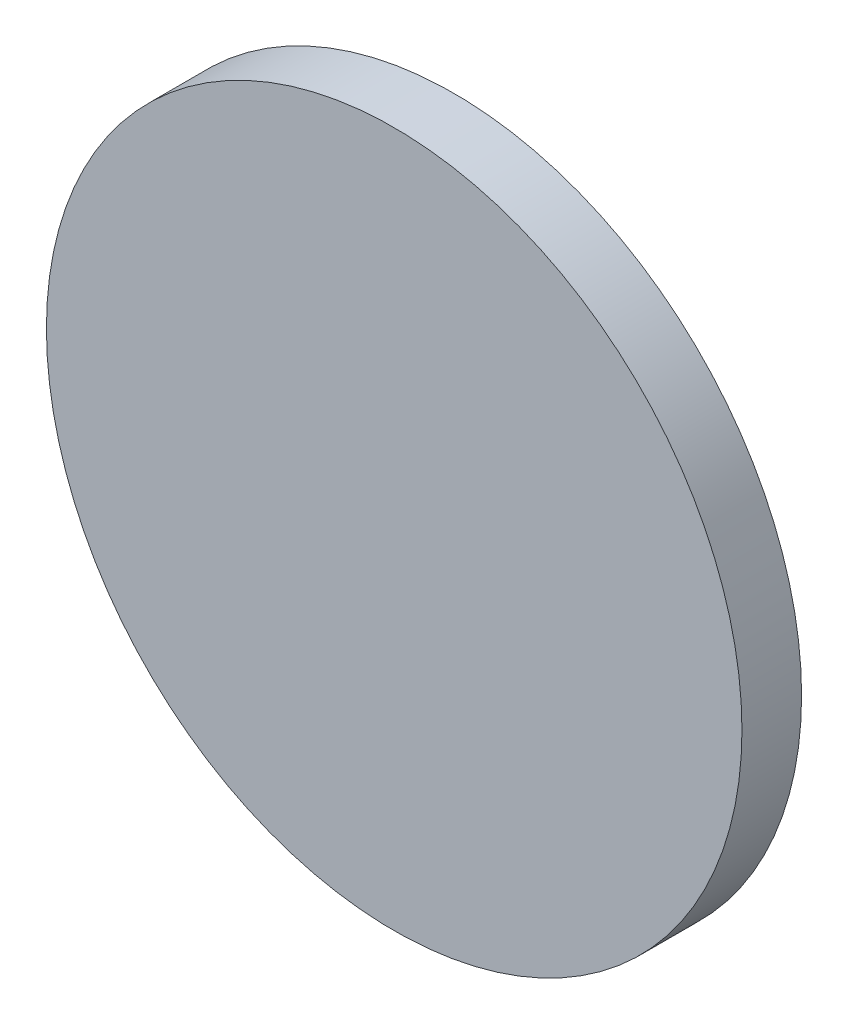
ISO-10303-21;
HEADER;
FILE_DESCRIPTION(('STEP AP214'),'2;1');
FILE_NAME('part.step','',(''),(''),'','','');
FILE_SCHEMA(('AUTOMOTIVE_DESIGN { 1 0 10303 214 1 1 1 1 }'));
ENDSEC;
DATA;
#1=APPLICATION_CONTEXT('core data for automotive mechanical design processes');
#2=APPLICATION_PROTOCOL_DEFINITION('international standard','automotive_design',2000,#1);
#3=PRODUCT_CONTEXT('',#1,'mechanical');
#4=PRODUCT('Part','Part','',(#3));
#5=PRODUCT_RELATED_PRODUCT_CATEGORY('part','',(#4));
#6=PRODUCT_DEFINITION_FORMATION('','',#4);
#7=PRODUCT_DEFINITION_CONTEXT('part definition',#1,'design');
#8=PRODUCT_DEFINITION('design','',#6,#7);
#9=PRODUCT_DEFINITION_SHAPE('','',#8);
#10=(LENGTH_UNIT() NAMED_UNIT(*) SI_UNIT(.MILLI.,.METRE.));
#11=(NAMED_UNIT(*) PLANE_ANGLE_UNIT() SI_UNIT($,.RADIAN.));
#12=(NAMED_UNIT(*) SI_UNIT($,.STERADIAN.) SOLID_ANGLE_UNIT());
#13=UNCERTAINTY_MEASURE_WITH_UNIT(LENGTH_MEASURE(1.E-05),#10,'distance_accuracy_value','');
#14=(GEOMETRIC_REPRESENTATION_CONTEXT(3) GLOBAL_UNCERTAINTY_ASSIGNED_CONTEXT((#13)) GLOBAL_UNIT_ASSIGNED_CONTEXT((#10,
#11,#12)) REPRESENTATION_CONTEXT('',''));
#15=CARTESIAN_POINT('',(0.,0.,0.));
#16=DIRECTION('',(0.,0.,1.));
#17=DIRECTION('',(1.,0.,0.));
#18=AXIS2_PLACEMENT_3D('',#15,#16,#17);
#19=CARTESIAN_POINT('',(1.6002,2.504440006176,0.));
#20=DIRECTION('',(0.,0.,-1.));
#21=DIRECTION('',(-1.,0.,0.));
#22=AXIS2_PLACEMENT_3D('',#19,#20,#21);
#23=PLANE('',#22);
#24=CARTESIAN_POINT('',(1.6002,2.504440006176,0.));
#25=DIRECTION('',(0.,0.,1.));
#26=DIRECTION('',(1.,0.,0.));
#27=AXIS2_PLACEMENT_3D('',#24,#25,#26);
#28=CIRCLE('',#27,0.200024667);
#29=CARTESIAN_POINT('',(1.800224667,2.504440006176,0.));
#30=VERTEX_POINT('',#29);
#31=EDGE_CURVE('E18',#30,#30,#28,.T.);
#32=ORIENTED_EDGE('',*,*,#31,.F.);
#33=EDGE_LOOP('',(#32));
#34=FACE_BOUND('',#33,.T.);
#35=ADVANCED_FACE('F15',(#34),#23,.T.);
#36=CARTESIAN_POINT('',(1.6002,2.504440006176,0.));
#37=DIRECTION('',(0.,0.,1.));
#38=DIRECTION('',(1.,0.,0.));
#39=AXIS2_PLACEMENT_3D('',#36,#37,#38);
#40=CYLINDRICAL_SURFACE('',#39,0.200024667);
#41=CARTESIAN_POINT('',(1.6002,2.504440006176,0.03429));
#42=DIRECTION('',(0.,0.,1.));
#43=DIRECTION('',(1.,0.,0.));
#44=AXIS2_PLACEMENT_3D('',#41,#42,#43);
#45=CIRCLE('',#44,0.200024667);
#46=CARTESIAN_POINT('',(1.800224667,2.504440006176,0.03429));
#47=VERTEX_POINT('',#46);
#48=EDGE_CURVE('E10',#47,#47,#45,.T.);
#49=ORIENTED_EDGE('',*,*,#48,.F.);
#50=EDGE_LOOP('',(#49));
#51=FACE_BOUND('',#50,.T.);
#52=ORIENTED_EDGE('',*,*,#31,.T.);
#53=EDGE_LOOP('',(#52));
#54=FACE_BOUND('',#53,.T.);
#55=ADVANCED_FACE('F27',(#51,#54),#40,.T.);
#56=CARTESIAN_POINT('',(1.6002,2.504440006176,0.03429));
#57=DIRECTION('',(0.,0.,1.));
#58=DIRECTION('',(1.,0.,0.));
#59=AXIS2_PLACEMENT_3D('',#56,#57,#58);
#60=PLANE('',#59);
#61=ORIENTED_EDGE('',*,*,#48,.T.);
#62=EDGE_LOOP('',(#61));
#63=FACE_BOUND('',#62,.T.);
#64=ADVANCED_FACE('F34',(#63),#60,.T.);
#65=CLOSED_SHELL('',(#35,#55,#64));
#66=MANIFOLD_SOLID_BREP('B1',#65);
#67=ADVANCED_BREP_SHAPE_REPRESENTATION('',(#18,#66),#14);
#68=SHAPE_DEFINITION_REPRESENTATION(#9,#67);
ENDSEC;
END-ISO-10303-21;
